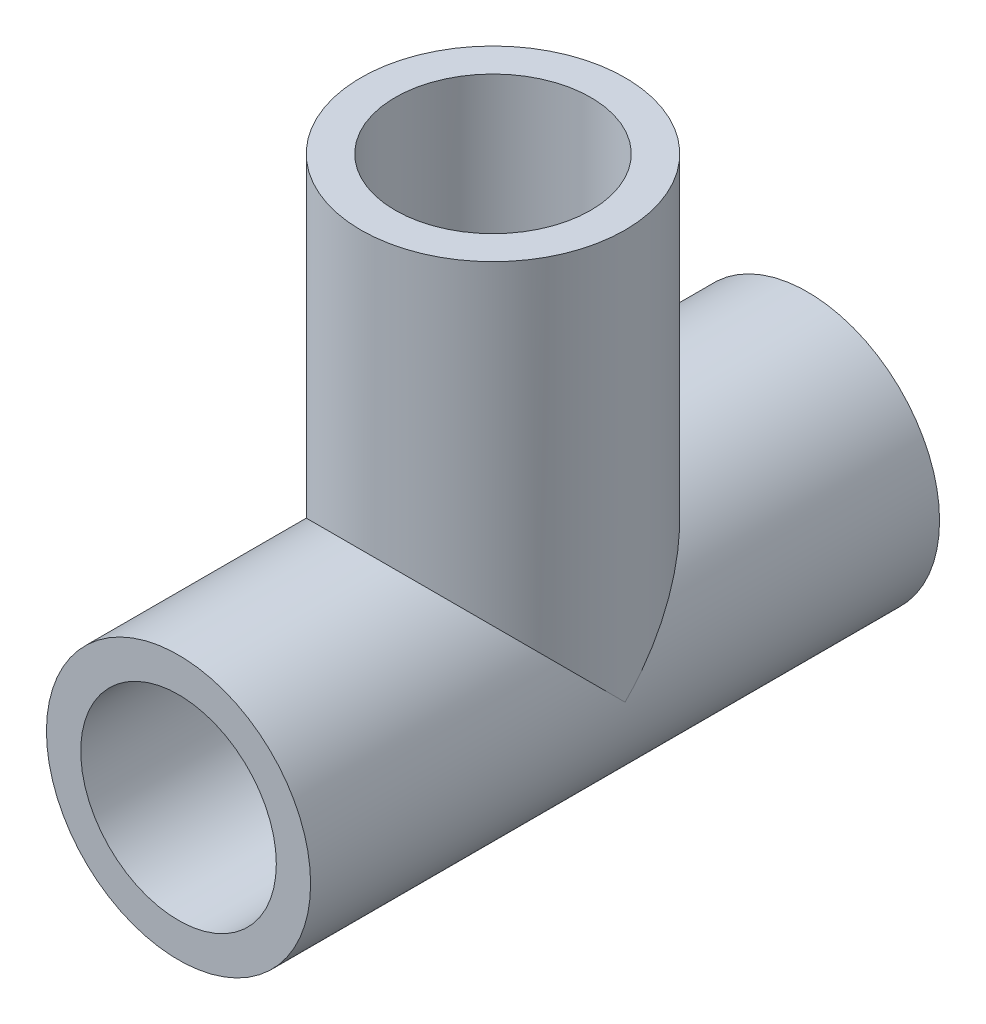
ISO-10303-21;
HEADER;
FILE_DESCRIPTION(('STEP AP214'),'2;1');
FILE_NAME('part.step','',(''),(''),'','','');
FILE_SCHEMA(('AUTOMOTIVE_DESIGN { 1 0 10303 214 1 1 1 1 }'));
ENDSEC;
DATA;
#1=APPLICATION_CONTEXT('core data for automotive mechanical design processes');
#2=APPLICATION_PROTOCOL_DEFINITION('international standard','automotive_design',2000,#1);
#3=PRODUCT_CONTEXT('',#1,'mechanical');
#4=PRODUCT('Part','Part','',(#3));
#5=PRODUCT_RELATED_PRODUCT_CATEGORY('part','',(#4));
#6=PRODUCT_DEFINITION_FORMATION('','',#4);
#7=PRODUCT_DEFINITION_CONTEXT('part definition',#1,'design');
#8=PRODUCT_DEFINITION('design','',#6,#7);
#9=PRODUCT_DEFINITION_SHAPE('','',#8);
#10=(LENGTH_UNIT() NAMED_UNIT(*) SI_UNIT(.MILLI.,.METRE.));
#11=(NAMED_UNIT(*) PLANE_ANGLE_UNIT() SI_UNIT($,.RADIAN.));
#12=(NAMED_UNIT(*) SI_UNIT($,.STERADIAN.) SOLID_ANGLE_UNIT());
#13=UNCERTAINTY_MEASURE_WITH_UNIT(LENGTH_MEASURE(1.E-05),#10,'distance_accuracy_value','');
#14=(GEOMETRIC_REPRESENTATION_CONTEXT(3) GLOBAL_UNCERTAINTY_ASSIGNED_CONTEXT((#13)) GLOBAL_UNIT_ASSIGNED_CONTEXT((#10,
#11,#12)) REPRESENTATION_CONTEXT('',''));
#15=CARTESIAN_POINT('',(0.,0.,0.));
#16=DIRECTION('',(0.,0.,1.));
#17=DIRECTION('',(1.,0.,0.));
#18=AXIS2_PLACEMENT_3D('',#15,#16,#17);
#19=CARTESIAN_POINT('',(0.,0.,50.8));
#20=DIRECTION('',(0.,0.,-1.));
#21=DIRECTION('',(-1.,0.,0.));
#22=AXIS2_PLACEMENT_3D('',#19,#20,#21);
#23=CYLINDRICAL_SURFACE('',#22,10.668);
#24=CARTESIAN_POINT('',(0.,0.,0.));
#25=DIRECTION('',(0.,0.,1.));
#26=DIRECTION('',(1.,0.,0.));
#27=AXIS2_PLACEMENT_3D('',#24,#25,#26);
#28=CIRCLE('',#27,10.668);
#29=CARTESIAN_POINT('',(10.668,0.,0.));
#30=VERTEX_POINT('',#29);
#31=EDGE_CURVE('E37',#30,#30,#28,.T.);
#32=ORIENTED_EDGE('',*,*,#31,.T.);
#33=EDGE_LOOP('',(#32));
#34=FACE_BOUND('',#33,.T.);
#35=CARTESIAN_POINT('',(0.,0.,50.8));
#36=DIRECTION('',(0.,0.,1.));
#37=DIRECTION('',(1.,0.,0.));
#38=AXIS2_PLACEMENT_3D('',#35,#36,#37);
#39=CIRCLE('',#38,10.668);
#40=CARTESIAN_POINT('',(10.668,0.,50.8));
#41=VERTEX_POINT('',#40);
#42=EDGE_CURVE('E11',#41,#41,#39,.T.);
#43=ORIENTED_EDGE('',*,*,#42,.F.);
#44=EDGE_LOOP('',(#43));
#45=FACE_BOUND('',#44,.T.);
#46=CARTESIAN_POINT('',(0.,0.,25.4));
#47=DIRECTION('',(0.,-0.707106781186547,-0.707106781186547));
#48=DIRECTION('',(0.,0.707106781186547,-0.707106781186547));
#49=AXIS2_PLACEMENT_3D('',#46,#47,#48);
#50=ELLIPSE('',#49,15.0868302833962,10.668);
#51=CARTESIAN_POINT('',(10.668,0.,25.4));
#52=VERTEX_POINT('',#51);
#53=CARTESIAN_POINT('',(-10.668,0.,25.4));
#54=VERTEX_POINT('',#53);
#55=EDGE_CURVE('E74',#52,#54,#50,.F.);
#56=ORIENTED_EDGE('',*,*,#55,.F.);
#57=CARTESIAN_POINT('',(0.,0.,25.4));
#58=DIRECTION('',(0.,0.707106781186547,-0.707106781186547));
#59=DIRECTION('',(0.,-0.707106781186547,-0.707106781186547));
#60=AXIS2_PLACEMENT_3D('',#57,#58,#59);
#61=ELLIPSE('',#60,15.0868302833962,10.668);
#62=EDGE_CURVE('E54',#54,#52,#61,.T.);
#63=ORIENTED_EDGE('',*,*,#62,.F.);
#64=EDGE_LOOP('',(#56,#63));
#65=FACE_BOUND('',#64,.T.);
#66=ADVANCED_FACE('F34',(#34,#45,#65),#23,.T.);
#67=CARTESIAN_POINT('',(0.,0.,50.8));
#68=DIRECTION('',(0.,0.,1.));
#69=DIRECTION('',(1.,0.,0.));
#70=AXIS2_PLACEMENT_3D('',#67,#68,#69);
#71=PLANE('',#70);
#72=ORIENTED_EDGE('',*,*,#42,.T.);
#73=EDGE_LOOP('',(#72));
#74=FACE_BOUND('',#73,.T.);
#75=CARTESIAN_POINT('',(0.,0.,50.8));
#76=DIRECTION('',(0.,0.,1.));
#77=DIRECTION('',(1.,0.,0.));
#78=AXIS2_PLACEMENT_3D('',#75,#76,#77);
#79=CIRCLE('',#78,7.8994);
#80=CARTESIAN_POINT('',(7.8994,0.,50.8));
#81=VERTEX_POINT('',#80);
#82=EDGE_CURVE('E77',#81,#81,#79,.T.);
#83=ORIENTED_EDGE('',*,*,#82,.F.);
#84=EDGE_LOOP('',(#83));
#85=FACE_BOUND('',#84,.T.);
#86=ADVANCED_FACE('F96',(#74,#85),#71,.T.);
#87=CARTESIAN_POINT('',(0.,0.,0.));
#88=DIRECTION('',(0.,0.,1.));
#89=DIRECTION('',(1.,0.,0.));
#90=AXIS2_PLACEMENT_3D('',#87,#88,#89);
#91=PLANE('',#90);
#92=ORIENTED_EDGE('',*,*,#31,.F.);
#93=EDGE_LOOP('',(#92));
#94=FACE_BOUND('',#93,.T.);
#95=CARTESIAN_POINT('',(0.,0.,0.));
#96=DIRECTION('',(0.,0.,1.));
#97=DIRECTION('',(1.,0.,0.));
#98=AXIS2_PLACEMENT_3D('',#95,#96,#97);
#99=CIRCLE('',#98,7.8994);
#100=CARTESIAN_POINT('',(7.8994,0.,0.));
#101=VERTEX_POINT('',#100);
#102=EDGE_CURVE('E76',#101,#101,#99,.T.);
#103=ORIENTED_EDGE('',*,*,#102,.T.);
#104=EDGE_LOOP('',(#103));
#105=FACE_BOUND('',#104,.T.);
#106=ADVANCED_FACE('F83',(#94,#105),#91,.F.);
#107=CARTESIAN_POINT('',(0.,33.02,25.4));
#108=DIRECTION('',(0.,-1.,0.));
#109=DIRECTION('',(0.,0.,-1.));
#110=AXIS2_PLACEMENT_3D('',#107,#108,#109);
#111=CYLINDRICAL_SURFACE('',#110,10.668);
#112=CARTESIAN_POINT('',(0.,33.02,25.4));
#113=DIRECTION('',(0.,1.,0.));
#114=DIRECTION('',(0.,0.,1.));
#115=AXIS2_PLACEMENT_3D('',#112,#113,#114);
#116=CIRCLE('',#115,10.668);
#117=CARTESIAN_POINT('',(0.,33.02,36.068));
#118=VERTEX_POINT('',#117);
#119=EDGE_CURVE('E68',#118,#118,#116,.T.);
#120=ORIENTED_EDGE('',*,*,#119,.F.);
#121=EDGE_LOOP('',(#120));
#122=FACE_BOUND('',#121,.T.);
#123=ORIENTED_EDGE('',*,*,#62,.T.);
#124=ORIENTED_EDGE('',*,*,#55,.T.);
#125=EDGE_LOOP('',(#123,#124));
#126=FACE_BOUND('',#125,.T.);
#127=ADVANCED_FACE('F107',(#122,#126),#111,.T.);
#128=CARTESIAN_POINT('',(0.,33.02,25.4));
#129=DIRECTION('',(0.,-1.,0.));
#130=DIRECTION('',(0.,0.,-1.));
#131=AXIS2_PLACEMENT_3D('',#128,#129,#130);
#132=CYLINDRICAL_SURFACE('',#131,7.8994);
#133=CARTESIAN_POINT('',(0.,33.02,25.4));
#134=DIRECTION('',(0.,1.,0.));
#135=DIRECTION('',(0.,0.,1.));
#136=AXIS2_PLACEMENT_3D('',#133,#134,#135);
#137=CIRCLE('',#136,7.8994);
#138=CARTESIAN_POINT('',(0.,33.02,33.2994));
#139=VERTEX_POINT('',#138);
#140=EDGE_CURVE('E65',#139,#139,#137,.T.);
#141=ORIENTED_EDGE('',*,*,#140,.T.);
#142=EDGE_LOOP('',(#141));
#143=FACE_BOUND('',#142,.T.);
#144=CARTESIAN_POINT('',(0.,0.,25.4));
#145=DIRECTION('',(0.,0.707106781186547,0.707106781186547));
#146=DIRECTION('',(0.,0.707106781186547,-0.707106781186547));
#147=AXIS2_PLACEMENT_3D('',#144,#145,#146);
#148=ELLIPSE('',#147,11.17143861461,7.8994);
#149=CARTESIAN_POINT('',(7.8994,0.,25.4));
#150=VERTEX_POINT('',#149);
#151=CARTESIAN_POINT('',(-7.8994,0.,25.4));
#152=VERTEX_POINT('',#151);
#153=EDGE_CURVE('E59',#150,#152,#148,.T.);
#154=ORIENTED_EDGE('',*,*,#153,.F.);
#155=CARTESIAN_POINT('',(0.,0.,25.4));
#156=DIRECTION('',(0.,0.707106781186547,-0.707106781186547));
#157=DIRECTION('',(0.,0.707106781186547,0.707106781186547));
#158=AXIS2_PLACEMENT_3D('',#155,#156,#157);
#159=ELLIPSE('',#158,11.17143861461,7.8994);
#160=EDGE_CURVE('E47',#152,#150,#159,.T.);
#161=ORIENTED_EDGE('',*,*,#160,.F.);
#162=EDGE_LOOP('',(#154,#161));
#163=FACE_BOUND('',#162,.T.);
#164=ADVANCED_FACE('F60',(#143,#163),#132,.F.);
#165=CARTESIAN_POINT('',(0.,33.02,25.4));
#166=DIRECTION('',(0.,1.,0.));
#167=DIRECTION('',(0.,0.,1.));
#168=AXIS2_PLACEMENT_3D('',#165,#166,#167);
#169=PLANE('',#168);
#170=ORIENTED_EDGE('',*,*,#119,.T.);
#171=EDGE_LOOP('',(#170));
#172=FACE_BOUND('',#171,.T.);
#173=ORIENTED_EDGE('',*,*,#140,.F.);
#174=EDGE_LOOP('',(#173));
#175=FACE_BOUND('',#174,.T.);
#176=ADVANCED_FACE('F86',(#172,#175),#169,.T.);
#177=CARTESIAN_POINT('',(0.,0.,50.8));
#178=DIRECTION('',(0.,0.,-1.));
#179=DIRECTION('',(-1.,0.,0.));
#180=AXIS2_PLACEMENT_3D('',#177,#178,#179);
#181=CYLINDRICAL_SURFACE('',#180,7.8994);
#182=ORIENTED_EDGE('',*,*,#160,.T.);
#183=ORIENTED_EDGE('',*,*,#153,.T.);
#184=EDGE_LOOP('',(#182,#183));
#185=FACE_BOUND('',#184,.T.);
#186=ORIENTED_EDGE('',*,*,#82,.T.);
#187=EDGE_LOOP('',(#186));
#188=FACE_BOUND('',#187,.T.);
#189=ORIENTED_EDGE('',*,*,#102,.F.);
#190=EDGE_LOOP('',(#189));
#191=FACE_BOUND('',#190,.T.);
#192=ADVANCED_FACE('F63',(#185,#188,#191),#181,.F.);
#193=CLOSED_SHELL('',(#66,#86,#106,#127,#164,#176,#192));
#194=MANIFOLD_SOLID_BREP('B2',#193);
#195=ADVANCED_BREP_SHAPE_REPRESENTATION('',(#18,#194),#14);
#196=SHAPE_DEFINITION_REPRESENTATION(#9,#195);
ENDSEC;
END-ISO-10303-21;
